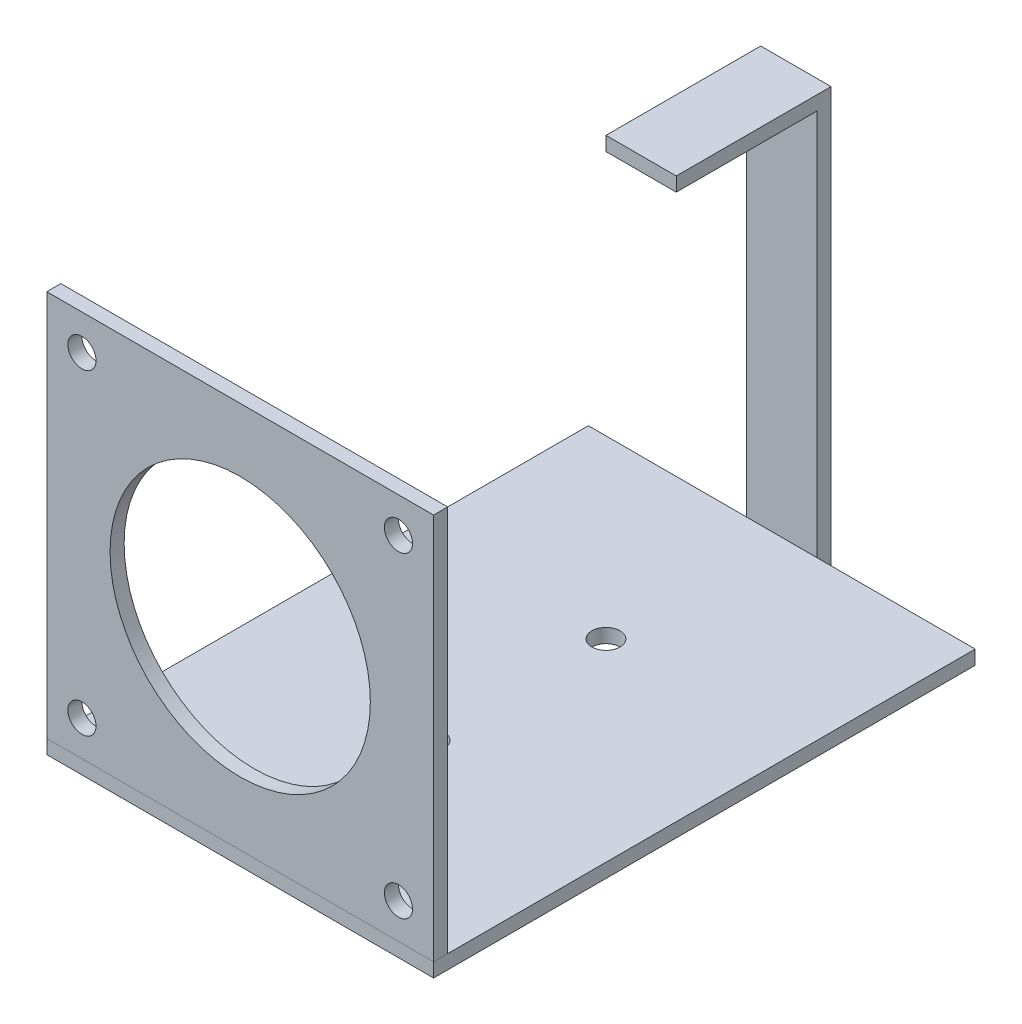
ISO-10303-21;
HEADER;
FILE_DESCRIPTION(('STEP AP214'),'2;1');
FILE_NAME('part.step','',(''),(''),'','','');
FILE_SCHEMA(('AUTOMOTIVE_DESIGN { 1 0 10303 214 1 1 1 1 }'));
ENDSEC;
DATA;
#1=APPLICATION_CONTEXT('core data for automotive mechanical design processes');
#2=APPLICATION_PROTOCOL_DEFINITION('international standard','automotive_design',2000,#1);
#3=PRODUCT_CONTEXT('',#1,'mechanical');
#4=PRODUCT('Part','Part','',(#3));
#5=PRODUCT_RELATED_PRODUCT_CATEGORY('part','',(#4));
#6=PRODUCT_DEFINITION_FORMATION('','',#4);
#7=PRODUCT_DEFINITION_CONTEXT('part definition',#1,'design');
#8=PRODUCT_DEFINITION('design','',#6,#7);
#9=PRODUCT_DEFINITION_SHAPE('','',#8);
#10=(LENGTH_UNIT() NAMED_UNIT(*) SI_UNIT(.MILLI.,.METRE.));
#11=(NAMED_UNIT(*) PLANE_ANGLE_UNIT() SI_UNIT($,.RADIAN.));
#12=(NAMED_UNIT(*) SI_UNIT($,.STERADIAN.) SOLID_ANGLE_UNIT());
#13=UNCERTAINTY_MEASURE_WITH_UNIT(LENGTH_MEASURE(1.E-05),#10,'distance_accuracy_value','');
#14=(GEOMETRIC_REPRESENTATION_CONTEXT(3) GLOBAL_UNCERTAINTY_ASSIGNED_CONTEXT((#13)) GLOBAL_UNIT_ASSIGNED_CONTEXT((#10,
#11,#12)) REPRESENTATION_CONTEXT('',''));
#15=CARTESIAN_POINT('',(0.,0.,0.));
#16=DIRECTION('',(0.,0.,1.));
#17=DIRECTION('',(1.,0.,0.));
#18=AXIS2_PLACEMENT_3D('',#15,#16,#17);
#19=CARTESIAN_POINT('',(-27.5,-29.5,-75.));
#20=DIRECTION('',(0.,0.,-1.));
#21=DIRECTION('',(-1.,0.,0.));
#22=AXIS2_PLACEMENT_3D('',#19,#20,#21);
#23=PLANE('',#22);
#24=DIRECTION('',(0.,1.,0.));
#25=VECTOR('',#24,1.);
#26=CARTESIAN_POINT('',(-4.99999999999999,27.5,-75.));
#27=LINE('',#26,#25);
#28=CARTESIAN_POINT('',(-5.,-29.5,-75.));
#29=VERTEX_POINT('',#28);
#30=CARTESIAN_POINT('',(-5.,-27.5,-75.));
#31=VERTEX_POINT('',#30);
#32=EDGE_CURVE('E176',#29,#31,#27,.T.);
#33=ORIENTED_EDGE('',*,*,#32,.F.);
#34=DIRECTION('',(1.,0.,0.));
#35=VECTOR('',#34,1.);
#36=CARTESIAN_POINT('',(-27.5,-29.5,-75.));
#37=LINE('',#36,#35);
#38=CARTESIAN_POINT('',(-27.5,-29.5,-75.));
#39=VERTEX_POINT('',#38);
#40=EDGE_CURVE('E211',#39,#29,#37,.T.);
#41=ORIENTED_EDGE('',*,*,#40,.F.);
#42=DIRECTION('',(0.,1.,0.));
#43=VECTOR('',#42,1.);
#44=CARTESIAN_POINT('',(-27.5,-29.5,-75.));
#45=LINE('',#44,#43);
#46=CARTESIAN_POINT('',(-27.5,-27.5,-75.));
#47=VERTEX_POINT('',#46);
#48=EDGE_CURVE('E197',#39,#47,#45,.T.);
#49=ORIENTED_EDGE('',*,*,#48,.T.);
#50=DIRECTION('',(1.,0.,0.));
#51=VECTOR('',#50,1.);
#52=CARTESIAN_POINT('',(-27.5,-27.5,-75.));
#53=LINE('',#52,#51);
#54=EDGE_CURVE('E51',#47,#31,#53,.T.);
#55=ORIENTED_EDGE('',*,*,#54,.T.);
#56=EDGE_LOOP('',(#33,#41,#49,#55));
#57=FACE_BOUND('',#56,.T.);
#58=ADVANCED_FACE('F42',(#57),#23,.T.);
#59=CARTESIAN_POINT('',(-27.5,-27.5,0.));
#60=DIRECTION('',(0.,1.,0.));
#61=DIRECTION('',(-1.,0.,0.));
#62=AXIS2_PLACEMENT_3D('',#59,#60,#61);
#63=PLANE('',#62);
#64=CARTESIAN_POINT('',(0.,-27.5,-50.));
#65=DIRECTION('',(0.,-1.,0.));
#66=DIRECTION('',(1.,0.,0.));
#67=AXIS2_PLACEMENT_3D('',#64,#65,#66);
#68=CIRCLE('',#67,2.);
#69=CARTESIAN_POINT('',(2.00000000000001,-27.5,-50.));
#70=VERTEX_POINT('',#69);
#71=EDGE_CURVE('E277',#70,#70,#68,.T.);
#72=ORIENTED_EDGE('',*,*,#71,.T.);
#73=EDGE_LOOP('',(#72));
#74=FACE_BOUND('',#73,.T.);
#75=CARTESIAN_POINT('',(0.,-27.5,-25.));
#76=DIRECTION('',(0.,-1.,0.));
#77=DIRECTION('',(1.,0.,0.));
#78=AXIS2_PLACEMENT_3D('',#75,#76,#77);
#79=CIRCLE('',#78,2.);
#80=CARTESIAN_POINT('',(2.,-27.5,-25.));
#81=VERTEX_POINT('',#80);
#82=EDGE_CURVE('E167',#81,#81,#79,.T.);
#83=ORIENTED_EDGE('',*,*,#82,.T.);
#84=EDGE_LOOP('',(#83));
#85=FACE_BOUND('',#84,.T.);
#86=DIRECTION('',(0.,0.,1.));
#87=VECTOR('',#86,1.);
#88=CARTESIAN_POINT('',(27.5,-27.5,0.));
#89=LINE('',#88,#87);
#90=CARTESIAN_POINT('',(27.5,-27.5,-75.));
#91=VERTEX_POINT('',#90);
#92=CARTESIAN_POINT('',(27.5,-27.5,2.));
#93=VERTEX_POINT('',#92);
#94=EDGE_CURVE('E191',#91,#93,#89,.T.);
#95=ORIENTED_EDGE('',*,*,#94,.F.);
#96=CARTESIAN_POINT('',(5.,-27.5,-75.));
#97=VERTEX_POINT('',#96);
#98=EDGE_CURVE('E210',#97,#91,#53,.T.);
#99=ORIENTED_EDGE('',*,*,#98,.F.);
#100=EDGE_CURVE('E65',#31,#97,#53,.T.);
#101=ORIENTED_EDGE('',*,*,#100,.F.);
#102=ORIENTED_EDGE('',*,*,#54,.F.);
#103=DIRECTION('',(0.,0.,1.));
#104=VECTOR('',#103,1.);
#105=CARTESIAN_POINT('',(-27.5,-27.5,2.));
#106=LINE('',#105,#104);
#107=CARTESIAN_POINT('',(-27.5,-27.5,2.));
#108=VERTEX_POINT('',#107);
#109=EDGE_CURVE('E187',#47,#108,#106,.T.);
#110=ORIENTED_EDGE('',*,*,#109,.T.);
#111=DIRECTION('',(1.,0.,0.));
#112=VECTOR('',#111,1.);
#113=CARTESIAN_POINT('',(-27.5,-27.5,2.));
#114=LINE('',#113,#112);
#115=EDGE_CURVE('E46',#108,#93,#114,.T.);
#116=ORIENTED_EDGE('',*,*,#115,.T.);
#117=EDGE_LOOP('',(#95,#99,#101,#102,#110,#116));
#118=FACE_BOUND('',#117,.T.);
#119=ADVANCED_FACE('F220',(#74,#85,#118),#63,.T.);
#120=DIRECTION('',(0.,-1.,0.));
#121=VECTOR('',#120,1.);
#122=CARTESIAN_POINT('',(5.,-29.5,-75.));
#123=LINE('',#122,#121);
#124=CARTESIAN_POINT('',(5.,-29.5,-75.));
#125=VERTEX_POINT('',#124);
#126=EDGE_CURVE('E12',#97,#125,#123,.T.);
#127=ORIENTED_EDGE('',*,*,#126,.F.);
#128=ORIENTED_EDGE('',*,*,#98,.T.);
#129=DIRECTION('',(0.,1.,0.));
#130=VECTOR('',#129,1.);
#131=CARTESIAN_POINT('',(27.5,-29.5,-75.));
#132=LINE('',#131,#130);
#133=CARTESIAN_POINT('',(27.5,-29.5,-75.));
#134=VERTEX_POINT('',#133);
#135=EDGE_CURVE('E205',#134,#91,#132,.T.);
#136=ORIENTED_EDGE('',*,*,#135,.F.);
#137=EDGE_CURVE('E213',#125,#134,#37,.T.);
#138=ORIENTED_EDGE('',*,*,#137,.F.);
#139=EDGE_LOOP('',(#127,#128,#136,#138));
#140=FACE_BOUND('',#139,.T.);
#141=ADVANCED_FACE('F225',(#140),#23,.T.);
#142=CARTESIAN_POINT('',(-27.5,-29.5,2.));
#143=DIRECTION('',(0.,-1.,0.));
#144=DIRECTION('',(1.,0.,0.));
#145=AXIS2_PLACEMENT_3D('',#142,#143,#144);
#146=PLANE('',#145);
#147=CARTESIAN_POINT('',(0.,-29.5,-50.));
#148=DIRECTION('',(0.,-1.,0.));
#149=DIRECTION('',(1.,0.,0.));
#150=AXIS2_PLACEMENT_3D('',#147,#148,#149);
#151=CIRCLE('',#150,2.);
#152=CARTESIAN_POINT('',(2.00000000000001,-29.5,-50.));
#153=VERTEX_POINT('',#152);
#154=EDGE_CURVE('E273',#153,#153,#151,.T.);
#155=ORIENTED_EDGE('',*,*,#154,.F.);
#156=EDGE_LOOP('',(#155));
#157=FACE_BOUND('',#156,.T.);
#158=CARTESIAN_POINT('',(0.,-29.5,-25.));
#159=DIRECTION('',(0.,-1.,0.));
#160=DIRECTION('',(1.,0.,0.));
#161=AXIS2_PLACEMENT_3D('',#158,#159,#160);
#162=CIRCLE('',#161,2.);
#163=CARTESIAN_POINT('',(2.,-29.5,-25.));
#164=VERTEX_POINT('',#163);
#165=EDGE_CURVE('E159',#164,#164,#162,.T.);
#166=ORIENTED_EDGE('',*,*,#165,.F.);
#167=EDGE_LOOP('',(#166));
#168=FACE_BOUND('',#167,.T.);
#169=DIRECTION('',(0.,0.,-1.));
#170=VECTOR('',#169,1.);
#171=CARTESIAN_POINT('',(27.5,-29.5,2.));
#172=LINE('',#171,#170);
#173=CARTESIAN_POINT('',(27.5,-29.5,2.));
#174=VERTEX_POINT('',#173);
#175=EDGE_CURVE('E202',#174,#134,#172,.T.);
#176=ORIENTED_EDGE('',*,*,#175,.F.);
#177=DIRECTION('',(1.,0.,0.));
#178=VECTOR('',#177,1.);
#179=CARTESIAN_POINT('',(-27.5,-29.5,2.));
#180=LINE('',#179,#178);
#181=CARTESIAN_POINT('',(-27.5,-29.5,2.));
#182=VERTEX_POINT('',#181);
#183=EDGE_CURVE('E214',#182,#174,#180,.T.);
#184=ORIENTED_EDGE('',*,*,#183,.F.);
#185=DIRECTION('',(0.,0.,-1.));
#186=VECTOR('',#185,1.);
#187=CARTESIAN_POINT('',(-27.5,-29.5,2.));
#188=LINE('',#187,#186);
#189=EDGE_CURVE('E194',#182,#39,#188,.T.);
#190=ORIENTED_EDGE('',*,*,#189,.T.);
#191=ORIENTED_EDGE('',*,*,#40,.T.);
#192=DIRECTION('',(0.,0.,1.));
#193=VECTOR('',#192,1.);
#194=CARTESIAN_POINT('',(-5.,-29.5,-77.));
#195=LINE('',#194,#193);
#196=CARTESIAN_POINT('',(-5.,-29.5,-77.));
#197=VERTEX_POINT('',#196);
#198=EDGE_CURVE('E184',#197,#29,#195,.T.);
#199=ORIENTED_EDGE('',*,*,#198,.F.);
#200=DIRECTION('',(-1.,0.,0.));
#201=VECTOR('',#200,1.);
#202=CARTESIAN_POINT('',(-5.,-29.5,-77.));
#203=LINE('',#202,#201);
#204=CARTESIAN_POINT('',(5.,-29.5,-77.));
#205=VERTEX_POINT('',#204);
#206=EDGE_CURVE('E133',#205,#197,#203,.T.);
#207=ORIENTED_EDGE('',*,*,#206,.F.);
#208=DIRECTION('',(0.,0.,1.));
#209=VECTOR('',#208,1.);
#210=CARTESIAN_POINT('',(5.,-29.5,-77.));
#211=LINE('',#210,#209);
#212=EDGE_CURVE('E175',#205,#125,#211,.T.);
#213=ORIENTED_EDGE('',*,*,#212,.T.);
#214=ORIENTED_EDGE('',*,*,#137,.T.);
#215=EDGE_LOOP('',(#176,#184,#190,#191,#199,#207,#213,#214));
#216=FACE_BOUND('',#215,.T.);
#217=ADVANCED_FACE('F242',(#157,#168,#216),#146,.T.);
#218=CARTESIAN_POINT('',(-27.5,-27.5,2.));
#219=DIRECTION('',(0.,0.,1.));
#220=DIRECTION('',(0.,-1.,0.));
#221=AXIS2_PLACEMENT_3D('',#218,#219,#220);
#222=PLANE('',#221);
#223=DIRECTION('',(0.,-1.,0.));
#224=VECTOR('',#223,1.);
#225=CARTESIAN_POINT('',(27.5,-27.5,2.));
#226=LINE('',#225,#224);
#227=EDGE_CURVE('E186',#93,#174,#226,.T.);
#228=ORIENTED_EDGE('',*,*,#227,.F.);
#229=ORIENTED_EDGE('',*,*,#115,.F.);
#230=DIRECTION('',(0.,-1.,0.));
#231=VECTOR('',#230,1.);
#232=CARTESIAN_POINT('',(-27.5,-27.5,2.));
#233=LINE('',#232,#231);
#234=EDGE_CURVE('E190',#108,#182,#233,.T.);
#235=ORIENTED_EDGE('',*,*,#234,.T.);
#236=ORIENTED_EDGE('',*,*,#183,.T.);
#237=EDGE_LOOP('',(#228,#229,#235,#236));
#238=FACE_BOUND('',#237,.T.);
#239=ADVANCED_FACE('F44',(#238),#222,.T.);
#240=CARTESIAN_POINT('',(-27.5,0.,0.));
#241=DIRECTION('',(1.,0.,0.));
#242=DIRECTION('',(0.,0.,-1.));
#243=AXIS2_PLACEMENT_3D('',#240,#241,#242);
#244=PLANE('',#243);
#245=ORIENTED_EDGE('',*,*,#109,.F.);
#246=ORIENTED_EDGE('',*,*,#48,.F.);
#247=ORIENTED_EDGE('',*,*,#189,.F.);
#248=ORIENTED_EDGE('',*,*,#234,.F.);
#249=EDGE_LOOP('',(#245,#246,#247,#248));
#250=FACE_BOUND('',#249,.T.);
#251=ADVANCED_FACE('F247',(#250),#244,.F.);
#252=CARTESIAN_POINT('',(27.5,0.,0.));
#253=DIRECTION('',(1.,0.,0.));
#254=DIRECTION('',(0.,0.,-1.));
#255=AXIS2_PLACEMENT_3D('',#252,#253,#254);
#256=PLANE('',#255);
#257=ORIENTED_EDGE('',*,*,#94,.T.);
#258=ORIENTED_EDGE('',*,*,#227,.T.);
#259=ORIENTED_EDGE('',*,*,#175,.T.);
#260=ORIENTED_EDGE('',*,*,#135,.T.);
#261=EDGE_LOOP('',(#257,#258,#259,#260));
#262=FACE_BOUND('',#261,.T.);
#263=ADVANCED_FACE('F223',(#262),#256,.T.);
#264=CARTESIAN_POINT('',(-4.99999999999999,27.5,-77.));
#265=DIRECTION('',(1.,0.,0.));
#266=DIRECTION('',(0.,1.,0.));
#267=AXIS2_PLACEMENT_3D('',#264,#265,#266);
#268=PLANE('',#267);
#269=ORIENTED_EDGE('',*,*,#32,.T.);
#270=CARTESIAN_POINT('',(-4.99999999999999,27.5,-75.));
#271=VERTEX_POINT('',#270);
#272=EDGE_CURVE('E172',#31,#271,#27,.T.);
#273=ORIENTED_EDGE('',*,*,#272,.T.);
#274=DIRECTION('',(0.,0.,1.));
#275=VECTOR('',#274,1.);
#276=CARTESIAN_POINT('',(-4.99999999999999,27.5,-77.));
#277=LINE('',#276,#275);
#278=CARTESIAN_POINT('',(-4.99999999999999,27.5,-55.));
#279=VERTEX_POINT('',#278);
#280=EDGE_CURVE('E165',#271,#279,#277,.T.);
#281=ORIENTED_EDGE('',*,*,#280,.T.);
#282=DIRECTION('',(0.,-1.,0.));
#283=VECTOR('',#282,1.);
#284=CARTESIAN_POINT('',(-4.99999999999999,29.5,-55.));
#285=LINE('',#284,#283);
#286=CARTESIAN_POINT('',(-4.99999999999999,29.5,-55.));
#287=VERTEX_POINT('',#286);
#288=EDGE_CURVE('E144',#287,#279,#285,.T.);
#289=ORIENTED_EDGE('',*,*,#288,.F.);
#290=DIRECTION('',(0.,0.,1.));
#291=VECTOR('',#290,1.);
#292=CARTESIAN_POINT('',(-4.99999999999999,29.5,-77.));
#293=LINE('',#292,#291);
#294=CARTESIAN_POINT('',(-4.99999999999999,29.5,-77.));
#295=VERTEX_POINT('',#294);
#296=EDGE_CURVE('E140',#295,#287,#293,.T.);
#297=ORIENTED_EDGE('',*,*,#296,.F.);
#298=DIRECTION('',(0.,1.,0.));
#299=VECTOR('',#298,1.);
#300=CARTESIAN_POINT('',(-4.99999999999999,27.5,-77.));
#301=LINE('',#300,#299);
#302=EDGE_CURVE('E127',#197,#295,#301,.T.);
#303=ORIENTED_EDGE('',*,*,#302,.F.);
#304=ORIENTED_EDGE('',*,*,#198,.T.);
#305=EDGE_LOOP('',(#269,#273,#281,#289,#297,#303,#304));
#306=FACE_BOUND('',#305,.T.);
#307=ADVANCED_FACE('F142',(#306),#268,.F.);
#308=CARTESIAN_POINT('',(5.,-29.5,-77.));
#309=DIRECTION('',(-1.,0.,0.));
#310=DIRECTION('',(0.,0.,1.));
#311=AXIS2_PLACEMENT_3D('',#308,#309,#310);
#312=PLANE('',#311);
#313=CARTESIAN_POINT('',(5.,27.5,-75.));
#314=VERTEX_POINT('',#313);
#315=EDGE_CURVE('E53',#314,#97,#123,.T.);
#316=ORIENTED_EDGE('',*,*,#315,.T.);
#317=ORIENTED_EDGE('',*,*,#126,.T.);
#318=ORIENTED_EDGE('',*,*,#212,.F.);
#319=DIRECTION('',(0.,-1.,0.));
#320=VECTOR('',#319,1.);
#321=CARTESIAN_POINT('',(5.,-29.5,-77.));
#322=LINE('',#321,#320);
#323=CARTESIAN_POINT('',(5.,29.5,-77.));
#324=VERTEX_POINT('',#323);
#325=EDGE_CURVE('E137',#324,#205,#322,.T.);
#326=ORIENTED_EDGE('',*,*,#325,.F.);
#327=DIRECTION('',(0.,0.,-1.));
#328=VECTOR('',#327,1.);
#329=CARTESIAN_POINT('',(5.00000000000001,29.5,-55.));
#330=LINE('',#329,#328);
#331=CARTESIAN_POINT('',(5.00000000000001,29.5,-55.));
#332=VERTEX_POINT('',#331);
#333=EDGE_CURVE('E152',#332,#324,#330,.T.);
#334=ORIENTED_EDGE('',*,*,#333,.F.);
#335=DIRECTION('',(0.,-1.,0.));
#336=VECTOR('',#335,1.);
#337=CARTESIAN_POINT('',(5.00000000000001,29.5,-55.));
#338=LINE('',#337,#336);
#339=CARTESIAN_POINT('',(5.00000000000001,27.5,-55.));
#340=VERTEX_POINT('',#339);
#341=EDGE_CURVE('E164',#332,#340,#338,.T.);
#342=ORIENTED_EDGE('',*,*,#341,.T.);
#343=DIRECTION('',(0.,0.,-1.));
#344=VECTOR('',#343,1.);
#345=CARTESIAN_POINT('',(5.00000000000001,27.5,-55.));
#346=LINE('',#345,#344);
#347=EDGE_CURVE('E153',#340,#314,#346,.T.);
#348=ORIENTED_EDGE('',*,*,#347,.T.);
#349=EDGE_LOOP('',(#316,#317,#318,#326,#334,#342,#348));
#350=FACE_BOUND('',#349,.T.);
#351=ADVANCED_FACE('F231',(#350),#312,.F.);
#352=CARTESIAN_POINT('',(0.,0.,-77.));
#353=DIRECTION('',(0.,0.,1.));
#354=DIRECTION('',(1.,0.,0.));
#355=AXIS2_PLACEMENT_3D('',#352,#353,#354);
#356=PLANE('',#355);
#357=ORIENTED_EDGE('',*,*,#206,.T.);
#358=ORIENTED_EDGE('',*,*,#302,.T.);
#359=DIRECTION('',(-1.,0.,0.));
#360=VECTOR('',#359,1.);
#361=CARTESIAN_POINT('',(5.,29.5,-77.));
#362=LINE('',#361,#360);
#363=EDGE_CURVE('E132',#324,#295,#362,.T.);
#364=ORIENTED_EDGE('',*,*,#363,.F.);
#365=ORIENTED_EDGE('',*,*,#325,.T.);
#366=EDGE_LOOP('',(#357,#358,#364,#365));
#367=FACE_BOUND('',#366,.T.);
#368=ADVANCED_FACE('F129',(#367),#356,.F.);
#369=CARTESIAN_POINT('',(0.,0.,-75.));
#370=DIRECTION('',(0.,0.,1.));
#371=DIRECTION('',(1.,0.,0.));
#372=AXIS2_PLACEMENT_3D('',#369,#370,#371);
#373=PLANE('',#372);
#374=ORIENTED_EDGE('',*,*,#272,.F.);
#375=ORIENTED_EDGE('',*,*,#100,.T.);
#376=ORIENTED_EDGE('',*,*,#315,.F.);
#377=DIRECTION('',(1.,0.,0.));
#378=VECTOR('',#377,1.);
#379=CARTESIAN_POINT('',(5.,27.5,-75.));
#380=LINE('',#379,#378);
#381=EDGE_CURVE('E178',#271,#314,#380,.T.);
#382=ORIENTED_EDGE('',*,*,#381,.F.);
#383=EDGE_LOOP('',(#374,#375,#376,#382));
#384=FACE_BOUND('',#383,.T.);
#385=ADVANCED_FACE('F228',(#384),#373,.T.);
#386=CARTESIAN_POINT('',(0.,27.5,0.));
#387=DIRECTION('',(0.,1.,0.));
#388=DIRECTION('',(0.,0.,1.));
#389=AXIS2_PLACEMENT_3D('',#386,#387,#388);
#390=PLANE('',#389);
#391=ORIENTED_EDGE('',*,*,#280,.F.);
#392=ORIENTED_EDGE('',*,*,#381,.T.);
#393=ORIENTED_EDGE('',*,*,#347,.F.);
#394=DIRECTION('',(1.,0.,0.));
#395=VECTOR('',#394,1.);
#396=CARTESIAN_POINT('',(-4.99999999999999,27.5,-55.));
#397=LINE('',#396,#395);
#398=EDGE_CURVE('E156',#279,#340,#397,.T.);
#399=ORIENTED_EDGE('',*,*,#398,.F.);
#400=EDGE_LOOP('',(#391,#392,#393,#399));
#401=FACE_BOUND('',#400,.T.);
#402=ADVANCED_FACE('F238',(#401),#390,.F.);
#403=CARTESIAN_POINT('',(-4.99999999999999,29.5,-55.));
#404=DIRECTION('',(0.,0.,-1.));
#405=DIRECTION('',(-1.,0.,0.));
#406=AXIS2_PLACEMENT_3D('',#403,#404,#405);
#407=PLANE('',#406);
#408=ORIENTED_EDGE('',*,*,#398,.T.);
#409=ORIENTED_EDGE('',*,*,#341,.F.);
#410=DIRECTION('',(1.,0.,0.));
#411=VECTOR('',#410,1.);
#412=CARTESIAN_POINT('',(-4.99999999999999,29.5,-55.));
#413=LINE('',#412,#411);
#414=EDGE_CURVE('E147',#287,#332,#413,.T.);
#415=ORIENTED_EDGE('',*,*,#414,.F.);
#416=ORIENTED_EDGE('',*,*,#288,.T.);
#417=EDGE_LOOP('',(#408,#409,#415,#416));
#418=FACE_BOUND('',#417,.T.);
#419=ADVANCED_FACE('F240',(#418),#407,.F.);
#420=CARTESIAN_POINT('',(0.,29.5,0.));
#421=DIRECTION('',(0.,1.,0.));
#422=DIRECTION('',(0.,0.,1.));
#423=AXIS2_PLACEMENT_3D('',#420,#421,#422);
#424=PLANE('',#423);
#425=ORIENTED_EDGE('',*,*,#363,.T.);
#426=ORIENTED_EDGE('',*,*,#296,.T.);
#427=ORIENTED_EDGE('',*,*,#414,.T.);
#428=ORIENTED_EDGE('',*,*,#333,.T.);
#429=EDGE_LOOP('',(#425,#426,#427,#428));
#430=FACE_BOUND('',#429,.T.);
#431=ADVANCED_FACE('F150',(#430),#424,.T.);
#432=CARTESIAN_POINT('',(0.,-27.5,-25.));
#433=DIRECTION('',(0.,-1.,0.));
#434=DIRECTION('',(1.,0.,0.));
#435=AXIS2_PLACEMENT_3D('',#432,#433,#434);
#436=CYLINDRICAL_SURFACE('',#435,2.);
#437=ORIENTED_EDGE('',*,*,#82,.F.);
#438=EDGE_LOOP('',(#437));
#439=FACE_BOUND('',#438,.T.);
#440=ORIENTED_EDGE('',*,*,#165,.T.);
#441=EDGE_LOOP('',(#440));
#442=FACE_BOUND('',#441,.T.);
#443=ADVANCED_FACE('F286',(#439,#442),#436,.F.);
#444=CARTESIAN_POINT('',(0.,-27.5,-50.));
#445=DIRECTION('',(0.,-1.,0.));
#446=DIRECTION('',(1.,0.,0.));
#447=AXIS2_PLACEMENT_3D('',#444,#445,#446);
#448=CYLINDRICAL_SURFACE('',#447,2.);
#449=ORIENTED_EDGE('',*,*,#71,.F.);
#450=EDGE_LOOP('',(#449));
#451=FACE_BOUND('',#450,.T.);
#452=ORIENTED_EDGE('',*,*,#154,.T.);
#453=EDGE_LOOP('',(#452));
#454=FACE_BOUND('',#453,.T.);
#455=ADVANCED_FACE('F284',(#451,#454),#448,.F.);
#456=CLOSED_SHELL('',(#58,#119,#141,#217,#239,#251,#263,#307,#351,#368,#385,#402,#419,#431,#443,#455));
#457=MANIFOLD_SOLID_BREP('B2',#456);
#458=CARTESIAN_POINT('',(0.,0.,2.));
#459=DIRECTION('',(0.,0.,1.));
#460=DIRECTION('',(1.,0.,0.));
#461=AXIS2_PLACEMENT_3D('',#458,#459,#460);
#462=PLANE('',#461);
#463=CARTESIAN_POINT('',(22.5,-22.5,2.));
#464=DIRECTION('',(0.,0.,1.));
#465=DIRECTION('',(1.,0.,0.));
#466=AXIS2_PLACEMENT_3D('',#463,#464,#465);
#467=CIRCLE('',#466,2.);
#468=CARTESIAN_POINT('',(24.5,-22.5,2.));
#469=VERTEX_POINT('',#468);
#470=EDGE_CURVE('E509',#469,#469,#467,.T.);
#471=ORIENTED_EDGE('',*,*,#470,.F.);
#472=EDGE_LOOP('',(#471));
#473=FACE_BOUND('',#472,.T.);
#474=CARTESIAN_POINT('',(22.5,22.5,2.));
#475=DIRECTION('',(0.,0.,1.));
#476=DIRECTION('',(1.,0.,0.));
#477=AXIS2_PLACEMENT_3D('',#474,#475,#476);
#478=CIRCLE('',#477,2.);
#479=CARTESIAN_POINT('',(24.5,22.5,2.));
#480=VERTEX_POINT('',#479);
#481=EDGE_CURVE('E497',#480,#480,#478,.T.);
#482=ORIENTED_EDGE('',*,*,#481,.F.);
#483=EDGE_LOOP('',(#482));
#484=FACE_BOUND('',#483,.T.);
#485=DIRECTION('',(0.,-1.,0.));
#486=VECTOR('',#485,1.);
#487=CARTESIAN_POINT('',(-27.5,27.5,2.));
#488=LINE('',#487,#486);
#489=CARTESIAN_POINT('',(-27.5,27.5,2.));
#490=VERTEX_POINT('',#489);
#491=CARTESIAN_POINT('',(-27.5,-27.5,2.));
#492=VERTEX_POINT('',#491);
#493=EDGE_CURVE('E467',#490,#492,#488,.T.);
#494=ORIENTED_EDGE('',*,*,#493,.T.);
#495=DIRECTION('',(1.,0.,0.));
#496=VECTOR('',#495,1.);
#497=CARTESIAN_POINT('',(-27.5,-27.5,2.));
#498=LINE('',#497,#496);
#499=CARTESIAN_POINT('',(27.5,-27.5,2.));
#500=VERTEX_POINT('',#499);
#501=EDGE_CURVE('E462',#492,#500,#498,.T.);
#502=ORIENTED_EDGE('',*,*,#501,.T.);
#503=DIRECTION('',(0.,1.,0.));
#504=VECTOR('',#503,1.);
#505=CARTESIAN_POINT('',(27.5,27.5,2.));
#506=LINE('',#505,#504);
#507=CARTESIAN_POINT('',(27.5,27.5,2.));
#508=VERTEX_POINT('',#507);
#509=EDGE_CURVE('E465',#500,#508,#506,.T.);
#510=ORIENTED_EDGE('',*,*,#509,.T.);
#511=DIRECTION('',(-1.,0.,0.));
#512=VECTOR('',#511,1.);
#513=CARTESIAN_POINT('',(-27.5,27.5,2.));
#514=LINE('',#513,#512);
#515=EDGE_CURVE('E432',#508,#490,#514,.T.);
#516=ORIENTED_EDGE('',*,*,#515,.T.);
#517=EDGE_LOOP('',(#494,#502,#510,#516));
#518=FACE_BOUND('',#517,.T.);
#519=CARTESIAN_POINT('',(-22.5,22.5,2.));
#520=DIRECTION('',(0.,0.,1.));
#521=DIRECTION('',(1.,0.,0.));
#522=AXIS2_PLACEMENT_3D('',#519,#520,#521);
#523=CIRCLE('',#522,2.);
#524=CARTESIAN_POINT('',(-20.5,22.5,2.));
#525=VERTEX_POINT('',#524);
#526=EDGE_CURVE('E482',#525,#525,#523,.T.);
#527=ORIENTED_EDGE('',*,*,#526,.F.);
#528=EDGE_LOOP('',(#527));
#529=FACE_BOUND('',#528,.T.);
#530=CARTESIAN_POINT('',(-22.5,-22.5,2.));
#531=DIRECTION('',(0.,0.,1.));
#532=DIRECTION('',(1.,0.,0.));
#533=AXIS2_PLACEMENT_3D('',#530,#531,#532);
#534=CIRCLE('',#533,2.);
#535=CARTESIAN_POINT('',(-20.5,-22.5,2.));
#536=VERTEX_POINT('',#535);
#537=EDGE_CURVE('E503',#536,#536,#534,.T.);
#538=ORIENTED_EDGE('',*,*,#537,.F.);
#539=EDGE_LOOP('',(#538));
#540=FACE_BOUND('',#539,.T.);
#541=CARTESIAN_POINT('',(0.,0.,2.));
#542=DIRECTION('',(0.,0.,1.));
#543=DIRECTION('',(1.,0.,0.));
#544=AXIS2_PLACEMENT_3D('',#541,#542,#543);
#545=CIRCLE('',#544,18.5);
#546=CARTESIAN_POINT('',(18.5,0.,2.));
#547=VERTEX_POINT('',#546);
#548=EDGE_CURVE('E515',#547,#547,#545,.T.);
#549=ORIENTED_EDGE('',*,*,#548,.F.);
#550=EDGE_LOOP('',(#549));
#551=FACE_BOUND('',#550,.T.);
#552=ADVANCED_FACE('F415',(#473,#484,#518,#529,#540,#551),#462,.T.);
#553=CARTESIAN_POINT('',(0.,0.,0.));
#554=DIRECTION('',(0.,0.,1.));
#555=DIRECTION('',(1.,0.,0.));
#556=AXIS2_PLACEMENT_3D('',#553,#554,#555);
#557=PLANE('',#556);
#558=DIRECTION('',(0.,-1.,0.));
#559=VECTOR('',#558,1.);
#560=CARTESIAN_POINT('',(-27.5,27.5,0.));
#561=LINE('',#560,#559);
#562=CARTESIAN_POINT('',(-27.5,27.5,0.));
#563=VERTEX_POINT('',#562);
#564=CARTESIAN_POINT('',(-27.5,-27.5,0.));
#565=VERTEX_POINT('',#564);
#566=EDGE_CURVE('E479',#563,#565,#561,.T.);
#567=ORIENTED_EDGE('',*,*,#566,.F.);
#568=DIRECTION('',(-1.,0.,0.));
#569=VECTOR('',#568,1.);
#570=CARTESIAN_POINT('',(-27.5,27.5,0.));
#571=LINE('',#570,#569);
#572=CARTESIAN_POINT('',(27.5,27.5,0.));
#573=VERTEX_POINT('',#572);
#574=EDGE_CURVE('E455',#573,#563,#571,.T.);
#575=ORIENTED_EDGE('',*,*,#574,.F.);
#576=DIRECTION('',(0.,1.,0.));
#577=VECTOR('',#576,1.);
#578=CARTESIAN_POINT('',(27.5,27.5,0.));
#579=LINE('',#578,#577);
#580=CARTESIAN_POINT('',(27.5,-27.5,0.));
#581=VERTEX_POINT('',#580);
#582=EDGE_CURVE('E449',#581,#573,#579,.T.);
#583=ORIENTED_EDGE('',*,*,#582,.F.);
#584=DIRECTION('',(1.,0.,0.));
#585=VECTOR('',#584,1.);
#586=CARTESIAN_POINT('',(-27.5,-27.5,0.));
#587=LINE('',#586,#585);
#588=EDGE_CURVE('E471',#565,#581,#587,.T.);
#589=ORIENTED_EDGE('',*,*,#588,.F.);
#590=EDGE_LOOP('',(#567,#575,#583,#589));
#591=FACE_BOUND('',#590,.T.);
#592=CARTESIAN_POINT('',(-22.5,22.5,0.));
#593=DIRECTION('',(0.,0.,1.));
#594=DIRECTION('',(1.,0.,0.));
#595=AXIS2_PLACEMENT_3D('',#592,#593,#594);
#596=CIRCLE('',#595,2.);
#597=CARTESIAN_POINT('',(-20.5,22.5,0.));
#598=VERTEX_POINT('',#597);
#599=EDGE_CURVE('E494',#598,#598,#596,.T.);
#600=ORIENTED_EDGE('',*,*,#599,.T.);
#601=EDGE_LOOP('',(#600));
#602=FACE_BOUND('',#601,.T.);
#603=CARTESIAN_POINT('',(22.5,22.5,0.));
#604=DIRECTION('',(0.,0.,1.));
#605=DIRECTION('',(1.,0.,0.));
#606=AXIS2_PLACEMENT_3D('',#603,#604,#605);
#607=CIRCLE('',#606,2.);
#608=CARTESIAN_POINT('',(24.5,22.5,0.));
#609=VERTEX_POINT('',#608);
#610=EDGE_CURVE('E500',#609,#609,#607,.T.);
#611=ORIENTED_EDGE('',*,*,#610,.T.);
#612=EDGE_LOOP('',(#611));
#613=FACE_BOUND('',#612,.T.);
#614=CARTESIAN_POINT('',(-22.5,-22.5,0.));
#615=DIRECTION('',(0.,0.,1.));
#616=DIRECTION('',(1.,0.,0.));
#617=AXIS2_PLACEMENT_3D('',#614,#615,#616);
#618=CIRCLE('',#617,2.);
#619=CARTESIAN_POINT('',(-20.5,-22.5,0.));
#620=VERTEX_POINT('',#619);
#621=EDGE_CURVE('E506',#620,#620,#618,.T.);
#622=ORIENTED_EDGE('',*,*,#621,.T.);
#623=EDGE_LOOP('',(#622));
#624=FACE_BOUND('',#623,.T.);
#625=CARTESIAN_POINT('',(22.5,-22.5,0.));
#626=DIRECTION('',(0.,0.,1.));
#627=DIRECTION('',(1.,0.,0.));
#628=AXIS2_PLACEMENT_3D('',#625,#626,#627);
#629=CIRCLE('',#628,2.);
#630=CARTESIAN_POINT('',(24.5,-22.5,0.));
#631=VERTEX_POINT('',#630);
#632=EDGE_CURVE('E512',#631,#631,#629,.T.);
#633=ORIENTED_EDGE('',*,*,#632,.T.);
#634=EDGE_LOOP('',(#633));
#635=FACE_BOUND('',#634,.T.);
#636=CARTESIAN_POINT('',(0.,0.,0.));
#637=DIRECTION('',(0.,0.,1.));
#638=DIRECTION('',(1.,0.,0.));
#639=AXIS2_PLACEMENT_3D('',#636,#637,#638);
#640=CIRCLE('',#639,18.5);
#641=CARTESIAN_POINT('',(18.5,0.,0.));
#642=VERTEX_POINT('',#641);
#643=EDGE_CURVE('E518',#642,#642,#640,.T.);
#644=ORIENTED_EDGE('',*,*,#643,.T.);
#645=EDGE_LOOP('',(#644));
#646=FACE_BOUND('',#645,.T.);
#647=ADVANCED_FACE('F490',(#591,#602,#613,#624,#635,#646),#557,.F.);
#648=CARTESIAN_POINT('',(-27.5,27.5,2.));
#649=DIRECTION('',(1.,0.,0.));
#650=DIRECTION('',(0.,1.,0.));
#651=AXIS2_PLACEMENT_3D('',#648,#649,#650);
#652=PLANE('',#651);
#653=ORIENTED_EDGE('',*,*,#566,.T.);
#654=DIRECTION('',(0.,0.,-1.));
#655=VECTOR('',#654,1.);
#656=CARTESIAN_POINT('',(-27.5,-27.5,2.));
#657=LINE('',#656,#655);
#658=EDGE_CURVE('E40',#492,#565,#657,.T.);
#659=ORIENTED_EDGE('',*,*,#658,.F.);
#660=ORIENTED_EDGE('',*,*,#493,.F.);
#661=DIRECTION('',(0.,0.,-1.));
#662=VECTOR('',#661,1.);
#663=CARTESIAN_POINT('',(-27.5,27.5,2.));
#664=LINE('',#663,#662);
#665=EDGE_CURVE('E475',#490,#563,#664,.T.);
#666=ORIENTED_EDGE('',*,*,#665,.T.);
#667=EDGE_LOOP('',(#653,#659,#660,#666));
#668=FACE_BOUND('',#667,.T.);
#669=ADVANCED_FACE('F417',(#668),#652,.F.);
#670=CARTESIAN_POINT('',(-27.5,-27.5,2.));
#671=DIRECTION('',(0.,1.,0.));
#672=DIRECTION('',(0.,0.,1.));
#673=AXIS2_PLACEMENT_3D('',#670,#671,#672);
#674=PLANE('',#673);
#675=ORIENTED_EDGE('',*,*,#588,.T.);
#676=DIRECTION('',(0.,0.,-1.));
#677=VECTOR('',#676,1.);
#678=CARTESIAN_POINT('',(27.5,-27.5,2.));
#679=LINE('',#678,#677);
#680=EDGE_CURVE('E424',#500,#581,#679,.T.);
#681=ORIENTED_EDGE('',*,*,#680,.F.);
#682=ORIENTED_EDGE('',*,*,#501,.F.);
#683=ORIENTED_EDGE('',*,*,#658,.T.);
#684=EDGE_LOOP('',(#675,#681,#682,#683));
#685=FACE_BOUND('',#684,.T.);
#686=ADVANCED_FACE('F470',(#685),#674,.F.);
#687=CARTESIAN_POINT('',(27.5,27.5,2.));
#688=DIRECTION('',(-1.,0.,0.));
#689=DIRECTION('',(0.,-1.,0.));
#690=AXIS2_PLACEMENT_3D('',#687,#688,#689);
#691=PLANE('',#690);
#692=ORIENTED_EDGE('',*,*,#582,.T.);
#693=DIRECTION('',(0.,0.,-1.));
#694=VECTOR('',#693,1.);
#695=CARTESIAN_POINT('',(27.5,27.5,2.));
#696=LINE('',#695,#694);
#697=EDGE_CURVE('E472',#508,#573,#696,.T.);
#698=ORIENTED_EDGE('',*,*,#697,.F.);
#699=ORIENTED_EDGE('',*,*,#509,.F.);
#700=ORIENTED_EDGE('',*,*,#680,.T.);
#701=EDGE_LOOP('',(#692,#698,#699,#700));
#702=FACE_BOUND('',#701,.T.);
#703=ADVANCED_FACE('F473',(#702),#691,.F.);
#704=CARTESIAN_POINT('',(-27.5,27.5,2.));
#705=DIRECTION('',(0.,-1.,0.));
#706=DIRECTION('',(0.,0.,-1.));
#707=AXIS2_PLACEMENT_3D('',#704,#705,#706);
#708=PLANE('',#707);
#709=ORIENTED_EDGE('',*,*,#574,.T.);
#710=ORIENTED_EDGE('',*,*,#665,.F.);
#711=ORIENTED_EDGE('',*,*,#515,.F.);
#712=ORIENTED_EDGE('',*,*,#697,.T.);
#713=EDGE_LOOP('',(#709,#710,#711,#712));
#714=FACE_BOUND('',#713,.T.);
#715=ADVANCED_FACE('F487',(#714),#708,.F.);
#716=CARTESIAN_POINT('',(-22.5,22.5,2.));
#717=DIRECTION('',(0.,0.,-1.));
#718=DIRECTION('',(-1.,0.,0.));
#719=AXIS2_PLACEMENT_3D('',#716,#717,#718);
#720=CYLINDRICAL_SURFACE('',#719,2.);
#721=ORIENTED_EDGE('',*,*,#526,.T.);
#722=EDGE_LOOP('',(#721));
#723=FACE_BOUND('',#722,.T.);
#724=ORIENTED_EDGE('',*,*,#599,.F.);
#725=EDGE_LOOP('',(#724));
#726=FACE_BOUND('',#725,.T.);
#727=ADVANCED_FACE('F537',(#723,#726),#720,.F.);
#728=CARTESIAN_POINT('',(22.5,22.5,2.));
#729=DIRECTION('',(0.,0.,-1.));
#730=DIRECTION('',(-1.,0.,0.));
#731=AXIS2_PLACEMENT_3D('',#728,#729,#730);
#732=CYLINDRICAL_SURFACE('',#731,2.);
#733=ORIENTED_EDGE('',*,*,#481,.T.);
#734=EDGE_LOOP('',(#733));
#735=FACE_BOUND('',#734,.T.);
#736=ORIENTED_EDGE('',*,*,#610,.F.);
#737=EDGE_LOOP('',(#736));
#738=FACE_BOUND('',#737,.T.);
#739=ADVANCED_FACE('F583',(#735,#738),#732,.F.);
#740=CARTESIAN_POINT('',(-22.5,-22.5,2.));
#741=DIRECTION('',(0.,0.,-1.));
#742=DIRECTION('',(-1.,0.,0.));
#743=AXIS2_PLACEMENT_3D('',#740,#741,#742);
#744=CYLINDRICAL_SURFACE('',#743,2.);
#745=ORIENTED_EDGE('',*,*,#537,.T.);
#746=EDGE_LOOP('',(#745));
#747=FACE_BOUND('',#746,.T.);
#748=ORIENTED_EDGE('',*,*,#621,.F.);
#749=EDGE_LOOP('',(#748));
#750=FACE_BOUND('',#749,.T.);
#751=ADVANCED_FACE('F591',(#747,#750),#744,.F.);
#752=CARTESIAN_POINT('',(22.5,-22.5,2.));
#753=DIRECTION('',(0.,0.,-1.));
#754=DIRECTION('',(-1.,0.,0.));
#755=AXIS2_PLACEMENT_3D('',#752,#753,#754);
#756=CYLINDRICAL_SURFACE('',#755,2.);
#757=ORIENTED_EDGE('',*,*,#470,.T.);
#758=EDGE_LOOP('',(#757));
#759=FACE_BOUND('',#758,.T.);
#760=ORIENTED_EDGE('',*,*,#632,.F.);
#761=EDGE_LOOP('',(#760));
#762=FACE_BOUND('',#761,.T.);
#763=ADVANCED_FACE('F599',(#759,#762),#756,.F.);
#764=CARTESIAN_POINT('',(0.,0.,2.));
#765=DIRECTION('',(0.,0.,-1.));
#766=DIRECTION('',(-1.,0.,0.));
#767=AXIS2_PLACEMENT_3D('',#764,#765,#766);
#768=CYLINDRICAL_SURFACE('',#767,18.5);
#769=ORIENTED_EDGE('',*,*,#548,.T.);
#770=EDGE_LOOP('',(#769));
#771=FACE_BOUND('',#770,.T.);
#772=ORIENTED_EDGE('',*,*,#643,.F.);
#773=EDGE_LOOP('',(#772));
#774=FACE_BOUND('',#773,.T.);
#775=ADVANCED_FACE('F524',(#771,#774),#768,.F.);
#776=CLOSED_SHELL('',(#552,#647,#669,#686,#703,#715,#727,#739,#751,#763,#775));
#777=MANIFOLD_SOLID_BREP('B6',#776);
#778=ADVANCED_BREP_SHAPE_REPRESENTATION('',(#18,#457,#777),#14);
#779=SHAPE_DEFINITION_REPRESENTATION(#9,#778);
ENDSEC;
END-ISO-10303-21;
